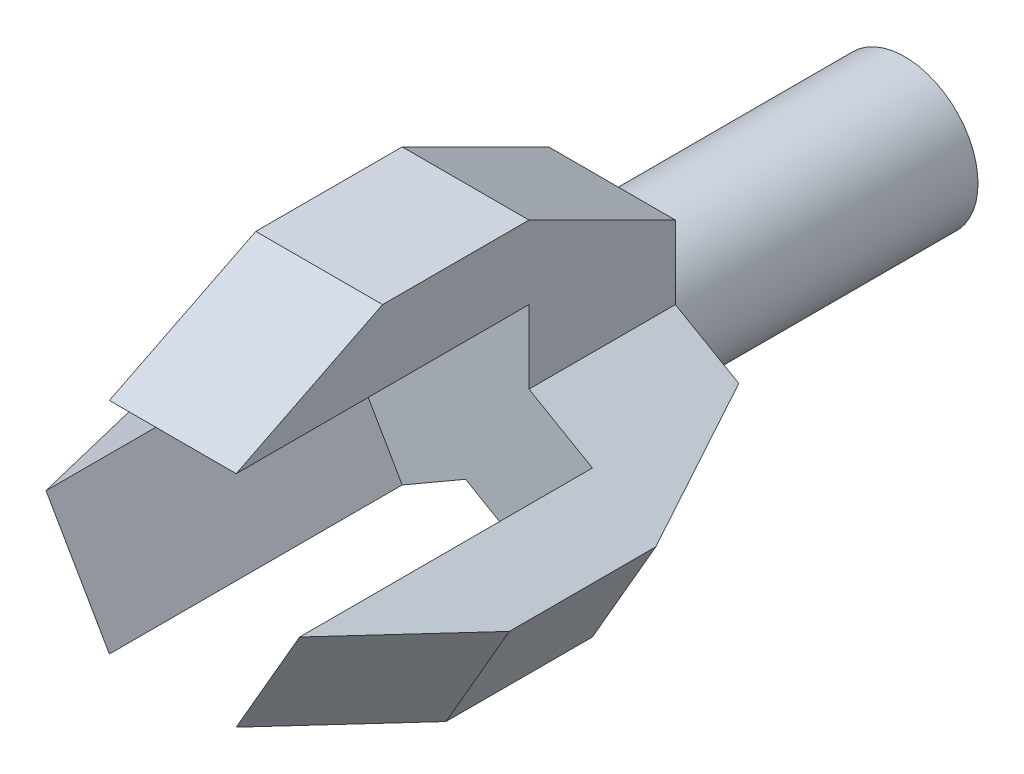
ISO-10303-21;
HEADER;
FILE_DESCRIPTION(('STEP AP214'),'2;1');
FILE_NAME('part.step','',(''),(''),'','','');
FILE_SCHEMA(('AUTOMOTIVE_DESIGN { 1 0 10303 214 1 1 1 1 }'));
ENDSEC;
DATA;
#1=APPLICATION_CONTEXT('core data for automotive mechanical design processes');
#2=APPLICATION_PROTOCOL_DEFINITION('international standard','automotive_design',2000,#1);
#3=PRODUCT_CONTEXT('',#1,'mechanical');
#4=PRODUCT('Part','Part','',(#3));
#5=PRODUCT_RELATED_PRODUCT_CATEGORY('part','',(#4));
#6=PRODUCT_DEFINITION_FORMATION('','',#4);
#7=PRODUCT_DEFINITION_CONTEXT('part definition',#1,'design');
#8=PRODUCT_DEFINITION('design','',#6,#7);
#9=PRODUCT_DEFINITION_SHAPE('','',#8);
#10=(LENGTH_UNIT() NAMED_UNIT(*) SI_UNIT(.MILLI.,.METRE.));
#11=(NAMED_UNIT(*) PLANE_ANGLE_UNIT() SI_UNIT($,.RADIAN.));
#12=(NAMED_UNIT(*) SI_UNIT($,.STERADIAN.) SOLID_ANGLE_UNIT());
#13=UNCERTAINTY_MEASURE_WITH_UNIT(LENGTH_MEASURE(1.E-05),#10,'distance_accuracy_value','');
#14=(GEOMETRIC_REPRESENTATION_CONTEXT(3) GLOBAL_UNCERTAINTY_ASSIGNED_CONTEXT((#13)) GLOBAL_UNIT_ASSIGNED_CONTEXT((#10,
#11,#12)) REPRESENTATION_CONTEXT('',''));
#15=CARTESIAN_POINT('',(0.,0.,0.));
#16=DIRECTION('',(0.,0.,1.));
#17=DIRECTION('',(1.,0.,0.));
#18=AXIS2_PLACEMENT_3D('',#15,#16,#17);
#19=CARTESIAN_POINT('',(0.,0.,200.));
#20=DIRECTION('',(0.,0.,-1.));
#21=DIRECTION('',(-1.,0.,0.));
#22=AXIS2_PLACEMENT_3D('',#19,#20,#21);
#23=CYLINDRICAL_SURFACE('',#22,50.);
#24=CARTESIAN_POINT('',(0.,0.,200.));
#25=DIRECTION('',(0.,0.,1.));
#26=DIRECTION('',(1.,0.,0.));
#27=AXIS2_PLACEMENT_3D('',#24,#25,#26);
#28=CIRCLE('',#27,50.);
#29=CARTESIAN_POINT('',(43.3012701892225,24.999999999999,200.));
#30=VERTEX_POINT('',#29);
#31=CARTESIAN_POINT('',(-43.3012701892218,25.0000000000002,200.));
#32=VERTEX_POINT('',#31);
#33=EDGE_CURVE('E11',#30,#32,#28,.T.);
#34=ORIENTED_EDGE('',*,*,#33,.F.);
#35=CARTESIAN_POINT('',(0.,0.,200.));
#36=DIRECTION('',(0.,0.,1.));
#37=DIRECTION('',(1.,0.,0.));
#38=AXIS2_PLACEMENT_3D('',#35,#36,#37);
#39=CIRCLE('',#38,50.);
#40=CARTESIAN_POINT('',(0.,-50.,200.));
#41=VERTEX_POINT('',#40);
#42=EDGE_CURVE('E361',#41,#30,#39,.T.);
#43=ORIENTED_EDGE('',*,*,#42,.F.);
#44=EDGE_CURVE('E41',#32,#41,#28,.T.);
#45=ORIENTED_EDGE('',*,*,#44,.F.);
#46=EDGE_LOOP('',(#34,#43,#45));
#47=FACE_BOUND('',#46,.T.);
#48=CARTESIAN_POINT('',(0.,0.,0.));
#49=DIRECTION('',(0.,0.,1.));
#50=DIRECTION('',(1.,0.,0.));
#51=AXIS2_PLACEMENT_3D('',#48,#49,#50);
#52=CIRCLE('',#51,50.);
#53=CARTESIAN_POINT('',(50.,0.,0.));
#54=VERTEX_POINT('',#53);
#55=EDGE_CURVE('E309',#54,#54,#52,.T.);
#56=ORIENTED_EDGE('',*,*,#55,.T.);
#57=EDGE_LOOP('',(#56));
#58=FACE_BOUND('',#57,.T.);
#59=ADVANCED_FACE('F33',(#47,#58),#23,.T.);
#60=CARTESIAN_POINT('',(0.,0.,0.));
#61=DIRECTION('',(0.,0.,1.));
#62=DIRECTION('',(1.,0.,0.));
#63=AXIS2_PLACEMENT_3D('',#60,#61,#62);
#64=PLANE('',#63);
#65=ORIENTED_EDGE('',*,*,#55,.F.);
#66=EDGE_LOOP('',(#65));
#67=FACE_BOUND('',#66,.T.);
#68=ADVANCED_FACE('F406',(#67),#64,.F.);
#69=CARTESIAN_POINT('',(5.20062834568508E-13,2.33066452422245E-13,200.));
#70=DIRECTION('',(0.,0.,1.));
#71=DIRECTION('',(1.,0.,0.));
#72=AXIS2_PLACEMENT_3D('',#69,#70,#71);
#73=PLANE('',#72);
#74=DIRECTION('',(0.,1.,0.));
#75=VECTOR('',#74,1.);
#76=CARTESIAN_POINT('',(43.3012701892218,25.0000000000002,200.));
#77=LINE('',#76,#75);
#78=CARTESIAN_POINT('',(43.3012701892224,75.0000000000016,200.));
#79=VERTEX_POINT('',#78);
#80=EDGE_CURVE('E324',#30,#79,#77,.T.);
#81=ORIENTED_EDGE('',*,*,#80,.F.);
#82=ORIENTED_EDGE('',*,*,#33,.T.);
#83=DIRECTION('',(0.,-1.,0.));
#84=VECTOR('',#83,1.);
#85=CARTESIAN_POINT('',(-43.3012701892211,74.9999999999998,200.));
#86=LINE('',#85,#84);
#87=CARTESIAN_POINT('',(-43.3012701892211,75.0000000000022,200.));
#88=VERTEX_POINT('',#87);
#89=EDGE_CURVE('E305',#88,#32,#86,.T.);
#90=ORIENTED_EDGE('',*,*,#89,.F.);
#91=DIRECTION('',(-1.,0.,0.));
#92=VECTOR('',#91,1.);
#93=CARTESIAN_POINT('',(43.3012701892223,74.9999999999991,200.));
#94=LINE('',#93,#92);
#95=EDGE_CURVE('E326',#79,#88,#94,.T.);
#96=ORIENTED_EDGE('',*,*,#95,.F.);
#97=EDGE_LOOP('',(#81,#82,#90,#96));
#98=FACE_BOUND('',#97,.T.);
#99=ADVANCED_FACE('F384',(#98),#73,.F.);
#100=CARTESIAN_POINT('',(43.3012701892218,25.0000000000002,300.));
#101=DIRECTION('',(-1.,0.,0.));
#102=DIRECTION('',(0.,-1.,0.));
#103=AXIS2_PLACEMENT_3D('',#100,#101,#102);
#104=PLANE('',#103);
#105=ORIENTED_EDGE('',*,*,#80,.T.);
#106=DIRECTION('',(0.,0.447213595499957,0.894427190999916));
#107=VECTOR('',#106,1.);
#108=CARTESIAN_POINT('',(43.3012701892224,75.0000000000017,200.));
#109=LINE('',#108,#107);
#110=CARTESIAN_POINT('',(43.3012701892228,125.000000000001,300.));
#111=VERTEX_POINT('',#110);
#112=EDGE_CURVE('E341',#79,#111,#109,.T.);
#113=ORIENTED_EDGE('',*,*,#112,.T.);
#114=DIRECTION('',(0.,0.,1.));
#115=VECTOR('',#114,1.);
#116=CARTESIAN_POINT('',(43.3012701892228,125.000000000001,300.));
#117=LINE('',#116,#115);
#118=CARTESIAN_POINT('',(43.3012701892228,125.000000000001,400.));
#119=VERTEX_POINT('',#118);
#120=EDGE_CURVE('E342',#111,#119,#117,.T.);
#121=ORIENTED_EDGE('',*,*,#120,.T.);
#122=DIRECTION('',(0.,-0.447213595499957,0.894427190999916));
#123=VECTOR('',#122,1.);
#124=CARTESIAN_POINT('',(43.3012701892228,125.000000000002,400.));
#125=LINE('',#124,#123);
#126=CARTESIAN_POINT('',(43.3012701892224,75.0000000000016,500.));
#127=VERTEX_POINT('',#126);
#128=EDGE_CURVE('E339',#119,#127,#125,.T.);
#129=ORIENTED_EDGE('',*,*,#128,.T.);
#130=DIRECTION('',(0.,0.,-1.));
#131=VECTOR('',#130,1.);
#132=CARTESIAN_POINT('',(43.3012701892224,75.0000000000016,200.));
#133=LINE('',#132,#131);
#134=CARTESIAN_POINT('',(43.3012701892224,75.0000000000016,300.));
#135=VERTEX_POINT('',#134);
#136=EDGE_CURVE('E327',#127,#135,#133,.T.);
#137=ORIENTED_EDGE('',*,*,#136,.T.);
#138=DIRECTION('',(0.,1.,0.));
#139=VECTOR('',#138,1.);
#140=CARTESIAN_POINT('',(43.3012701892218,25.0000000000002,300.));
#141=LINE('',#140,#139);
#142=CARTESIAN_POINT('',(43.3012701892225,24.999999999999,300.));
#143=VERTEX_POINT('',#142);
#144=EDGE_CURVE('E317',#143,#135,#141,.T.);
#145=ORIENTED_EDGE('',*,*,#144,.F.);
#146=DIRECTION('',(0.,0.,-1.));
#147=VECTOR('',#146,1.);
#148=CARTESIAN_POINT('',(43.3012701892218,25.0000000000002,300.));
#149=LINE('',#148,#147);
#150=EDGE_CURVE('E306',#143,#30,#149,.T.);
#151=ORIENTED_EDGE('',*,*,#150,.T.);
#152=EDGE_LOOP('',(#105,#113,#121,#129,#137,#145,#151));
#153=FACE_BOUND('',#152,.T.);
#154=ADVANCED_FACE('F336',(#153),#104,.F.);
#155=CARTESIAN_POINT('',(-43.3012701892211,74.9999999999998,300.));
#156=DIRECTION('',(1.,0.,0.));
#157=DIRECTION('',(0.,1.,0.));
#158=AXIS2_PLACEMENT_3D('',#155,#156,#157);
#159=PLANE('',#158);
#160=ORIENTED_EDGE('',*,*,#89,.T.);
#161=DIRECTION('',(0.,0.,-1.));
#162=VECTOR('',#161,1.);
#163=CARTESIAN_POINT('',(-43.3012701892215,25.0000000000008,300.));
#164=LINE('',#163,#162);
#165=CARTESIAN_POINT('',(-43.3012701892218,25.0000000000002,300.));
#166=VERTEX_POINT('',#165);
#167=EDGE_CURVE('E299',#166,#32,#164,.T.);
#168=ORIENTED_EDGE('',*,*,#167,.F.);
#169=DIRECTION('',(0.,-1.,0.));
#170=VECTOR('',#169,1.);
#171=CARTESIAN_POINT('',(-43.3012701892211,74.9999999999998,300.));
#172=LINE('',#171,#170);
#173=CARTESIAN_POINT('',(-43.3012701892211,74.9999999999998,300.));
#174=VERTEX_POINT('',#173);
#175=EDGE_CURVE('E295',#174,#166,#172,.T.);
#176=ORIENTED_EDGE('',*,*,#175,.F.);
#177=DIRECTION('',(0.,0.,1.));
#178=VECTOR('',#177,1.);
#179=CARTESIAN_POINT('',(-43.3012701892211,75.0000000000022,200.));
#180=LINE('',#179,#178);
#181=CARTESIAN_POINT('',(-43.3012701892211,75.0000000000022,500.));
#182=VERTEX_POINT('',#181);
#183=EDGE_CURVE('E49',#174,#182,#180,.T.);
#184=ORIENTED_EDGE('',*,*,#183,.T.);
#185=DIRECTION('',(0.,0.447213595499957,-0.894427190999916));
#186=VECTOR('',#185,1.);
#187=CARTESIAN_POINT('',(-43.3012701892208,125.000000000002,400.));
#188=LINE('',#187,#186);
#189=CARTESIAN_POINT('',(-43.3012701892208,125.000000000002,400.));
#190=VERTEX_POINT('',#189);
#191=EDGE_CURVE('E356',#182,#190,#188,.T.);
#192=ORIENTED_EDGE('',*,*,#191,.T.);
#193=DIRECTION('',(0.,0.,-1.));
#194=VECTOR('',#193,1.);
#195=CARTESIAN_POINT('',(-43.3012701892208,125.000000000002,300.));
#196=LINE('',#195,#194);
#197=CARTESIAN_POINT('',(-43.3012701892208,125.000000000002,300.));
#198=VERTEX_POINT('',#197);
#199=EDGE_CURVE('E350',#190,#198,#196,.T.);
#200=ORIENTED_EDGE('',*,*,#199,.T.);
#201=DIRECTION('',(0.,-0.447213595499957,-0.894427190999916));
#202=VECTOR('',#201,1.);
#203=CARTESIAN_POINT('',(-43.3012701892211,75.0000000000022,200.));
#204=LINE('',#203,#202);
#205=EDGE_CURVE('E360',#198,#88,#204,.T.);
#206=ORIENTED_EDGE('',*,*,#205,.T.);
#207=EDGE_LOOP('',(#160,#168,#176,#184,#192,#200,#206));
#208=FACE_BOUND('',#207,.T.);
#209=ADVANCED_FACE('F302',(#208),#159,.F.);
#210=CARTESIAN_POINT('',(5.20062834568508E-13,2.33066452422245E-13,300.));
#211=DIRECTION('',(0.,0.,1.));
#212=DIRECTION('',(1.,0.,0.));
#213=AXIS2_PLACEMENT_3D('',#210,#211,#212);
#214=PLANE('',#213);
#215=DIRECTION('',(-0.866025403784433,0.50000000000001,0.));
#216=VECTOR('',#215,1.);
#217=CARTESIAN_POINT('',(86.6025403784433,-9.99200722162641E-13,300.));
#218=LINE('',#217,#216);
#219=CARTESIAN_POINT('',(86.6025403784433,-9.99200722162641E-13,300.));
#220=VERTEX_POINT('',#219);
#221=EDGE_CURVE('E200',#220,#143,#218,.T.);
#222=ORIENTED_EDGE('',*,*,#221,.T.);
#223=ORIENTED_EDGE('',*,*,#144,.T.);
#224=DIRECTION('',(-1.,0.,0.));
#225=VECTOR('',#224,1.);
#226=CARTESIAN_POINT('',(43.3012701892223,74.9999999999991,300.));
#227=LINE('',#226,#225);
#228=EDGE_CURVE('E53',#135,#174,#227,.T.);
#229=ORIENTED_EDGE('',*,*,#228,.T.);
#230=ORIENTED_EDGE('',*,*,#175,.T.);
#231=DIRECTION('',(-0.866025403784448,-0.499999999999984,0.));
#232=VECTOR('',#231,1.);
#233=CARTESIAN_POINT('',(-43.3012701892218,25.0000000000002,300.));
#234=LINE('',#233,#232);
#235=CARTESIAN_POINT('',(-86.6025403784454,3.28440978118276E-13,300.));
#236=VERTEX_POINT('',#235);
#237=EDGE_CURVE('E185',#166,#236,#234,.T.);
#238=ORIENTED_EDGE('',*,*,#237,.T.);
#239=DIRECTION('',(0.499999999999985,-0.866025403784447,0.));
#240=VECTOR('',#239,1.);
#241=CARTESIAN_POINT('',(-86.6025403784433,1.57512891618694E-12,300.));
#242=LINE('',#241,#240);
#243=CARTESIAN_POINT('',(-43.3012701892229,-74.9999999999988,300.));
#244=VERTEX_POINT('',#243);
#245=EDGE_CURVE('E188',#236,#244,#242,.T.);
#246=ORIENTED_EDGE('',*,*,#245,.T.);
#247=DIRECTION('',(0.866025403784447,0.499999999999986,0.));
#248=VECTOR('',#247,1.);
#249=CARTESIAN_POINT('',(-43.3012701892229,-74.9999999999988,300.));
#250=LINE('',#249,#248);
#251=CARTESIAN_POINT('',(0.,-50.,300.));
#252=VERTEX_POINT('',#251);
#253=EDGE_CURVE('E216',#244,#252,#250,.T.);
#254=ORIENTED_EDGE('',*,*,#253,.T.);
#255=DIRECTION('',(0.866025403784432,-0.500000000000012,0.));
#256=VECTOR('',#255,1.);
#257=CARTESIAN_POINT('',(0.,-50.,300.));
#258=LINE('',#257,#256);
#259=CARTESIAN_POINT('',(43.3012701892228,-75.0000000000013,300.));
#260=VERTEX_POINT('',#259);
#261=EDGE_CURVE('E201',#252,#260,#258,.T.);
#262=ORIENTED_EDGE('',*,*,#261,.T.);
#263=DIRECTION('',(0.500000000000011,0.866025403784433,0.));
#264=VECTOR('',#263,1.);
#265=CARTESIAN_POINT('',(43.3012701892206,-75.0000000000001,300.));
#266=LINE('',#265,#264);
#267=EDGE_CURVE('E196',#260,#220,#266,.T.);
#268=ORIENTED_EDGE('',*,*,#267,.T.);
#269=EDGE_LOOP('',(#222,#223,#229,#230,#238,#246,#254,#262,#268));
#270=FACE_BOUND('',#269,.T.);
#271=ADVANCED_FACE('F292',(#270),#214,.T.);
#272=CARTESIAN_POINT('',(347.439396704133,74.9999999999993,200.));
#273=DIRECTION('',(0.,-1.,0.));
#274=DIRECTION('',(1.,0.,0.));
#275=AXIS2_PLACEMENT_3D('',#272,#273,#274);
#276=PLANE('',#275);
#277=ORIENTED_EDGE('',*,*,#228,.F.);
#278=ORIENTED_EDGE('',*,*,#136,.F.);
#279=DIRECTION('',(-1.,0.,0.));
#280=VECTOR('',#279,1.);
#281=CARTESIAN_POINT('',(347.439396704133,74.9999999999994,500.));
#282=LINE('',#281,#280);
#283=EDGE_CURVE('E347',#127,#182,#282,.T.);
#284=ORIENTED_EDGE('',*,*,#283,.T.);
#285=ORIENTED_EDGE('',*,*,#183,.F.);
#286=EDGE_LOOP('',(#277,#278,#284,#285));
#287=FACE_BOUND('',#286,.T.);
#288=ADVANCED_FACE('F395',(#287),#276,.T.);
#289=CARTESIAN_POINT('',(347.439396704133,74.9999999999993,200.));
#290=DIRECTION('',(0.,0.894427190999916,-0.447213595499957));
#291=DIRECTION('',(0.,0.447213595499957,0.894427190999916));
#292=AXIS2_PLACEMENT_3D('',#289,#290,#291);
#293=PLANE('',#292);
#294=ORIENTED_EDGE('',*,*,#112,.F.);
#295=ORIENTED_EDGE('',*,*,#95,.T.);
#296=ORIENTED_EDGE('',*,*,#205,.F.);
#297=DIRECTION('',(-1.,0.,0.));
#298=VECTOR('',#297,1.);
#299=CARTESIAN_POINT('',(347.439396704134,124.999999999999,300.));
#300=LINE('',#299,#298);
#301=EDGE_CURVE('E352',#111,#198,#300,.T.);
#302=ORIENTED_EDGE('',*,*,#301,.F.);
#303=EDGE_LOOP('',(#294,#295,#296,#302));
#304=FACE_BOUND('',#303,.T.);
#305=ADVANCED_FACE('F391',(#304),#293,.T.);
#306=CARTESIAN_POINT('',(347.439396704134,124.999999999999,300.));
#307=DIRECTION('',(0.,1.,0.));
#308=DIRECTION('',(-1.,0.,0.));
#309=AXIS2_PLACEMENT_3D('',#306,#307,#308);
#310=PLANE('',#309);
#311=ORIENTED_EDGE('',*,*,#120,.F.);
#312=ORIENTED_EDGE('',*,*,#301,.T.);
#313=ORIENTED_EDGE('',*,*,#199,.F.);
#314=DIRECTION('',(-1.,0.,0.));
#315=VECTOR('',#314,1.);
#316=CARTESIAN_POINT('',(347.439396704134,124.999999999999,400.));
#317=LINE('',#316,#315);
#318=EDGE_CURVE('E349',#119,#190,#317,.T.);
#319=ORIENTED_EDGE('',*,*,#318,.F.);
#320=EDGE_LOOP('',(#311,#312,#313,#319));
#321=FACE_BOUND('',#320,.T.);
#322=ADVANCED_FACE('F389',(#321),#310,.T.);
#323=CARTESIAN_POINT('',(347.439396704134,124.999999999999,400.));
#324=DIRECTION('',(0.,0.894427190999916,0.447213595499957));
#325=DIRECTION('',(0.,-0.447213595499957,0.894427190999916));
#326=AXIS2_PLACEMENT_3D('',#323,#324,#325);
#327=PLANE('',#326);
#328=ORIENTED_EDGE('',*,*,#128,.F.);
#329=ORIENTED_EDGE('',*,*,#318,.T.);
#330=ORIENTED_EDGE('',*,*,#191,.F.);
#331=ORIENTED_EDGE('',*,*,#283,.F.);
#332=EDGE_LOOP('',(#328,#329,#330,#331));
#333=FACE_BOUND('',#332,.T.);
#334=ADVANCED_FACE('F394',(#333),#327,.T.);
#335=CARTESIAN_POINT('',(0.,-5.66920852511594E-13,200.));
#336=DIRECTION('',(0.,0.,1.));
#337=DIRECTION('',(-0.500000000000004,-0.866025403784436,0.));
#338=AXIS2_PLACEMENT_3D('',#335,#336,#337);
#339=PLANE('',#338);
#340=DIRECTION('',(-0.866025403784448,-0.499999999999984,0.));
#341=VECTOR('',#340,1.);
#342=CARTESIAN_POINT('',(-43.3012701892218,25.0000000000002,200.));
#343=LINE('',#342,#341);
#344=CARTESIAN_POINT('',(-86.6025403784453,3.33066907387547E-13,200.));
#345=VERTEX_POINT('',#344);
#346=EDGE_CURVE('E170',#32,#345,#343,.T.);
#347=ORIENTED_EDGE('',*,*,#346,.F.);
#348=ORIENTED_EDGE('',*,*,#44,.T.);
#349=DIRECTION('',(0.866025403784447,0.499999999999986,0.));
#350=VECTOR('',#349,1.);
#351=CARTESIAN_POINT('',(-43.3012701892229,-74.9999999999988,200.));
#352=LINE('',#351,#350);
#353=CARTESIAN_POINT('',(-43.3012701892249,-75.,200.));
#354=VERTEX_POINT('',#353);
#355=EDGE_CURVE('E169',#354,#41,#352,.T.);
#356=ORIENTED_EDGE('',*,*,#355,.F.);
#357=DIRECTION('',(0.499999999999985,-0.866025403784447,0.));
#358=VECTOR('',#357,1.);
#359=CARTESIAN_POINT('',(-86.6025403784433,1.57512891618694E-12,200.));
#360=LINE('',#359,#358);
#361=EDGE_CURVE('E158',#345,#354,#360,.T.);
#362=ORIENTED_EDGE('',*,*,#361,.F.);
#363=EDGE_LOOP('',(#347,#348,#356,#362));
#364=FACE_BOUND('',#363,.T.);
#365=ADVANCED_FACE('F182',(#364),#339,.F.);
#366=DIRECTION('',(0.866025403784432,-0.500000000000012,0.));
#367=VECTOR('',#366,1.);
#368=CARTESIAN_POINT('',(0.,-50.,200.));
#369=LINE('',#368,#367);
#370=CARTESIAN_POINT('',(43.3012701892228,-75.0000000000013,200.));
#371=VERTEX_POINT('',#370);
#372=EDGE_CURVE('E193',#41,#371,#369,.T.);
#373=ORIENTED_EDGE('',*,*,#372,.F.);
#374=ORIENTED_EDGE('',*,*,#42,.T.);
#375=DIRECTION('',(-0.866025403784433,0.50000000000001,0.));
#376=VECTOR('',#375,1.);
#377=CARTESIAN_POINT('',(86.6025403784433,-9.99200722162641E-13,200.));
#378=LINE('',#377,#376);
#379=CARTESIAN_POINT('',(86.6025403784454,-2.19269047363468E-12,200.));
#380=VERTEX_POINT('',#379);
#381=EDGE_CURVE('E210',#380,#30,#378,.T.);
#382=ORIENTED_EDGE('',*,*,#381,.F.);
#383=DIRECTION('',(0.500000000000011,0.866025403784433,0.));
#384=VECTOR('',#383,1.);
#385=CARTESIAN_POINT('',(43.3012701892206,-75.0000000000001,200.));
#386=LINE('',#385,#384);
#387=EDGE_CURVE('E368',#371,#380,#386,.T.);
#388=ORIENTED_EDGE('',*,*,#387,.F.);
#389=EDGE_LOOP('',(#373,#374,#382,#388));
#390=FACE_BOUND('',#389,.T.);
#391=ADVANCED_FACE('F376',(#390),#339,.F.);
#392=CARTESIAN_POINT('',(0.,-50.,300.));
#393=DIRECTION('',(0.500000000000012,0.866025403784432,0.));
#394=DIRECTION('',(-0.866025403784432,0.500000000000012,0.));
#395=AXIS2_PLACEMENT_3D('',#392,#393,#394);
#396=PLANE('',#395);
#397=ORIENTED_EDGE('',*,*,#372,.T.);
#398=DIRECTION('',(0.387298334620738,-0.223606797749984,0.894427190999916));
#399=VECTOR('',#398,1.);
#400=CARTESIAN_POINT('',(43.3012701892229,-75.0000000000014,200.));
#401=LINE('',#400,#399);
#402=CARTESIAN_POINT('',(86.6025403784443,-100.000000000002,300.));
#403=VERTEX_POINT('',#402);
#404=EDGE_CURVE('E226',#371,#403,#401,.T.);
#405=ORIENTED_EDGE('',*,*,#404,.T.);
#406=DIRECTION('',(0.,0.,1.));
#407=VECTOR('',#406,1.);
#408=CARTESIAN_POINT('',(86.6025403784443,-100.000000000002,300.));
#409=LINE('',#408,#407);
#410=CARTESIAN_POINT('',(86.6025403784442,-100.000000000002,400.));
#411=VERTEX_POINT('',#410);
#412=EDGE_CURVE('E229',#403,#411,#409,.T.);
#413=ORIENTED_EDGE('',*,*,#412,.T.);
#414=DIRECTION('',(-0.387298334620738,0.223606797749984,0.894427190999916));
#415=VECTOR('',#414,1.);
#416=CARTESIAN_POINT('',(86.6025403784444,-100.000000000002,400.));
#417=LINE('',#416,#415);
#418=CARTESIAN_POINT('',(43.3012701892228,-75.0000000000014,500.));
#419=VERTEX_POINT('',#418);
#420=EDGE_CURVE('E242',#411,#419,#417,.T.);
#421=ORIENTED_EDGE('',*,*,#420,.T.);
#422=DIRECTION('',(0.,0.,-1.));
#423=VECTOR('',#422,1.);
#424=CARTESIAN_POINT('',(43.3012701892228,-75.0000000000013,200.));
#425=LINE('',#424,#423);
#426=EDGE_CURVE('E223',#419,#260,#425,.T.);
#427=ORIENTED_EDGE('',*,*,#426,.T.);
#428=ORIENTED_EDGE('',*,*,#261,.F.);
#429=DIRECTION('',(0.,0.,-1.));
#430=VECTOR('',#429,1.);
#431=CARTESIAN_POINT('',(0.,-50.,300.));
#432=LINE('',#431,#430);
#433=EDGE_CURVE('E205',#252,#41,#432,.T.);
#434=ORIENTED_EDGE('',*,*,#433,.T.);
#435=EDGE_LOOP('',(#397,#405,#413,#421,#427,#428,#434));
#436=FACE_BOUND('',#435,.T.);
#437=ADVANCED_FACE('F374',(#436),#396,.F.);
#438=CARTESIAN_POINT('',(86.6025403784433,-9.99200722162641E-13,300.));
#439=DIRECTION('',(-0.50000000000001,-0.866025403784433,0.));
#440=DIRECTION('',(0.866025403784433,-0.50000000000001,0.));
#441=AXIS2_PLACEMENT_3D('',#438,#439,#440);
#442=PLANE('',#441);
#443=ORIENTED_EDGE('',*,*,#381,.T.);
#444=ORIENTED_EDGE('',*,*,#150,.F.);
#445=ORIENTED_EDGE('',*,*,#221,.F.);
#446=DIRECTION('',(0.,0.,1.));
#447=VECTOR('',#446,1.);
#448=CARTESIAN_POINT('',(86.6025403784454,-2.19269047363468E-12,200.));
#449=LINE('',#448,#447);
#450=CARTESIAN_POINT('',(86.6025403784454,-2.2065682614425E-12,500.));
#451=VERTEX_POINT('',#450);
#452=EDGE_CURVE('E220',#220,#451,#449,.T.);
#453=ORIENTED_EDGE('',*,*,#452,.T.);
#454=DIRECTION('',(0.387298334620738,-0.223606797749983,-0.894427190999916));
#455=VECTOR('',#454,1.);
#456=CARTESIAN_POINT('',(129.903810567667,-25.0000000000027,400.));
#457=LINE('',#456,#455);
#458=CARTESIAN_POINT('',(129.903810567667,-25.0000000000027,400.));
#459=VERTEX_POINT('',#458);
#460=EDGE_CURVE('E245',#451,#459,#457,.T.);
#461=ORIENTED_EDGE('',*,*,#460,.T.);
#462=DIRECTION('',(0.,0.,-1.));
#463=VECTOR('',#462,1.);
#464=CARTESIAN_POINT('',(129.903810567667,-25.0000000000027,300.));
#465=LINE('',#464,#463);
#466=CARTESIAN_POINT('',(129.903810567667,-25.0000000000027,300.));
#467=VERTEX_POINT('',#466);
#468=EDGE_CURVE('E238',#459,#467,#465,.T.);
#469=ORIENTED_EDGE('',*,*,#468,.T.);
#470=DIRECTION('',(-0.387298334620739,0.223606797749983,-0.894427190999916));
#471=VECTOR('',#470,1.);
#472=CARTESIAN_POINT('',(86.6025403784454,-2.19269047363468E-12,200.));
#473=LINE('',#472,#471);
#474=EDGE_CURVE('E249',#467,#380,#473,.T.);
#475=ORIENTED_EDGE('',*,*,#474,.T.);
#476=EDGE_LOOP('',(#443,#444,#445,#453,#461,#469,#475));
#477=FACE_BOUND('',#476,.T.);
#478=ADVANCED_FACE('F380',(#477),#442,.F.);
#479=CARTESIAN_POINT('',(-43.3012701892218,25.0000000000002,300.));
#480=DIRECTION('',(0.499999999999984,-0.866025403784448,0.));
#481=DIRECTION('',(0.866025403784448,0.499999999999984,0.));
#482=AXIS2_PLACEMENT_3D('',#479,#480,#481);
#483=PLANE('',#482);
#484=ORIENTED_EDGE('',*,*,#346,.T.);
#485=DIRECTION('',(-0.387298334620745,-0.223606797749971,0.894427190999916));
#486=VECTOR('',#485,1.);
#487=CARTESIAN_POINT('',(-86.6025403784456,2.22044604925031E-13,200.000000000001));
#488=LINE('',#487,#486);
#489=CARTESIAN_POINT('',(-129.903810567668,-24.9999999999989,300.));
#490=VERTEX_POINT('',#489);
#491=EDGE_CURVE('E164',#345,#490,#488,.T.);
#492=ORIENTED_EDGE('',*,*,#491,.T.);
#493=DIRECTION('',(0.,0.,1.));
#494=VECTOR('',#493,1.);
#495=CARTESIAN_POINT('',(-129.903810567668,-24.9999999999989,300.));
#496=LINE('',#495,#494);
#497=CARTESIAN_POINT('',(-129.903810567668,-24.9999999999988,400.));
#498=VERTEX_POINT('',#497);
#499=EDGE_CURVE('E286',#490,#498,#496,.T.);
#500=ORIENTED_EDGE('',*,*,#499,.T.);
#501=DIRECTION('',(0.387298334620745,0.223606797749971,0.894427190999917));
#502=VECTOR('',#501,1.);
#503=CARTESIAN_POINT('',(-129.903810567668,-24.9999999999989,400.));
#504=LINE('',#503,#502);
#505=CARTESIAN_POINT('',(-86.6025403784455,4.44089209850063E-13,500.));
#506=VERTEX_POINT('',#505);
#507=EDGE_CURVE('E267',#498,#506,#504,.T.);
#508=ORIENTED_EDGE('',*,*,#507,.T.);
#509=DIRECTION('',(0.,0.,-1.));
#510=VECTOR('',#509,1.);
#511=CARTESIAN_POINT('',(-86.6025403784453,3.33066907387547E-13,200.));
#512=LINE('',#511,#510);
#513=EDGE_CURVE('E251',#506,#236,#512,.T.);
#514=ORIENTED_EDGE('',*,*,#513,.T.);
#515=ORIENTED_EDGE('',*,*,#237,.F.);
#516=ORIENTED_EDGE('',*,*,#167,.T.);
#517=EDGE_LOOP('',(#484,#492,#500,#508,#514,#515,#516));
#518=FACE_BOUND('',#517,.T.);
#519=ADVANCED_FACE('F289',(#518),#483,.F.);
#520=CARTESIAN_POINT('',(-43.3012701892229,-74.9999999999988,300.));
#521=DIRECTION('',(-0.499999999999986,0.866025403784447,0.));
#522=DIRECTION('',(-0.866025403784447,-0.499999999999986,0.));
#523=AXIS2_PLACEMENT_3D('',#520,#521,#522);
#524=PLANE('',#523);
#525=ORIENTED_EDGE('',*,*,#355,.T.);
#526=ORIENTED_EDGE('',*,*,#433,.F.);
#527=ORIENTED_EDGE('',*,*,#253,.F.);
#528=DIRECTION('',(0.,0.,1.));
#529=VECTOR('',#528,1.);
#530=CARTESIAN_POINT('',(-43.3012701892249,-75.,200.));
#531=LINE('',#530,#529);
#532=CARTESIAN_POINT('',(-43.301270189225,-75.,500.));
#533=VERTEX_POINT('',#532);
#534=EDGE_CURVE('E180',#244,#533,#531,.T.);
#535=ORIENTED_EDGE('',*,*,#534,.T.);
#536=DIRECTION('',(-0.387298334620745,-0.223606797749972,-0.894427190999916));
#537=VECTOR('',#536,1.);
#538=CARTESIAN_POINT('',(-86.6025403784472,-99.9999999999992,400.));
#539=LINE('',#538,#537);
#540=CARTESIAN_POINT('',(-86.6025403784472,-99.9999999999992,400.));
#541=VERTEX_POINT('',#540);
#542=EDGE_CURVE('E257',#533,#541,#539,.T.);
#543=ORIENTED_EDGE('',*,*,#542,.T.);
#544=DIRECTION('',(0.,0.,-1.));
#545=VECTOR('',#544,1.);
#546=CARTESIAN_POINT('',(-86.6025403784472,-99.9999999999993,300.));
#547=LINE('',#546,#545);
#548=CARTESIAN_POINT('',(-86.6025403784472,-99.9999999999993,300.));
#549=VERTEX_POINT('',#548);
#550=EDGE_CURVE('E179',#541,#549,#547,.T.);
#551=ORIENTED_EDGE('',*,*,#550,.T.);
#552=DIRECTION('',(0.387298334620745,0.223606797749972,-0.894427190999916));
#553=VECTOR('',#552,1.);
#554=CARTESIAN_POINT('',(-43.3012701892249,-75.,200.));
#555=LINE('',#554,#553);
#556=EDGE_CURVE('E162',#549,#354,#555,.T.);
#557=ORIENTED_EDGE('',*,*,#556,.T.);
#558=EDGE_LOOP('',(#525,#526,#527,#535,#543,#551,#557));
#559=FACE_BOUND('',#558,.T.);
#560=ADVANCED_FACE('F174',(#559),#524,.F.);
#561=CARTESIAN_POINT('',(-206.452959791578,-507.587015731978,200.));
#562=DIRECTION('',(-0.866025403784433,0.50000000000001,0.));
#563=DIRECTION('',(-0.50000000000001,-0.866025403784433,0.));
#564=AXIS2_PLACEMENT_3D('',#561,#562,#563);
#565=PLANE('',#564);
#566=ORIENTED_EDGE('',*,*,#267,.F.);
#567=ORIENTED_EDGE('',*,*,#426,.F.);
#568=DIRECTION('',(0.50000000000001,0.866025403784433,0.));
#569=VECTOR('',#568,1.);
#570=CARTESIAN_POINT('',(-206.452959791578,-507.587015731978,500.));
#571=LINE('',#570,#569);
#572=EDGE_CURVE('E234',#419,#451,#571,.T.);
#573=ORIENTED_EDGE('',*,*,#572,.T.);
#574=ORIENTED_EDGE('',*,*,#452,.F.);
#575=EDGE_LOOP('',(#566,#567,#573,#574));
#576=FACE_BOUND('',#575,.T.);
#577=ADVANCED_FACE('F485',(#576),#565,.T.);
#578=CARTESIAN_POINT('',(-206.452959791578,-507.587015731978,200.));
#579=DIRECTION('',(0.774596669241478,-0.447213595499967,-0.447213595499957));
#580=DIRECTION('',(0.50000000000001,0.866025403784433,0.));
#581=AXIS2_PLACEMENT_3D('',#578,#579,#580);
#582=PLANE('',#581);
#583=ORIENTED_EDGE('',*,*,#404,.F.);
#584=ORIENTED_EDGE('',*,*,#387,.T.);
#585=ORIENTED_EDGE('',*,*,#474,.F.);
#586=DIRECTION('',(0.50000000000001,0.866025403784433,0.));
#587=VECTOR('',#586,1.);
#588=CARTESIAN_POINT('',(-163.151689602356,-532.587015731978,300.));
#589=LINE('',#588,#587);
#590=EDGE_CURVE('E240',#403,#467,#589,.T.);
#591=ORIENTED_EDGE('',*,*,#590,.F.);
#592=EDGE_LOOP('',(#583,#584,#585,#591));
#593=FACE_BOUND('',#592,.T.);
#594=ADVANCED_FACE('F494',(#593),#582,.T.);
#595=CARTESIAN_POINT('',(-163.151689602356,-532.587015731978,300.));
#596=DIRECTION('',(0.866025403784433,-0.50000000000001,0.));
#597=DIRECTION('',(0.50000000000001,0.866025403784433,0.));
#598=AXIS2_PLACEMENT_3D('',#595,#596,#597);
#599=PLANE('',#598);
#600=ORIENTED_EDGE('',*,*,#412,.F.);
#601=ORIENTED_EDGE('',*,*,#590,.T.);
#602=ORIENTED_EDGE('',*,*,#468,.F.);
#603=DIRECTION('',(0.50000000000001,0.866025403784433,0.));
#604=VECTOR('',#603,1.);
#605=CARTESIAN_POINT('',(-163.151689602356,-532.587015731978,400.));
#606=LINE('',#605,#604);
#607=EDGE_CURVE('E237',#411,#459,#606,.T.);
#608=ORIENTED_EDGE('',*,*,#607,.F.);
#609=EDGE_LOOP('',(#600,#601,#602,#608));
#610=FACE_BOUND('',#609,.T.);
#611=ADVANCED_FACE('F504',(#610),#599,.T.);
#612=CARTESIAN_POINT('',(-163.151689602356,-532.587015731978,400.));
#613=DIRECTION('',(0.774596669241478,-0.447213595499967,0.447213595499957));
#614=DIRECTION('',(0.50000000000001,0.866025403784433,0.));
#615=AXIS2_PLACEMENT_3D('',#612,#613,#614);
#616=PLANE('',#615);
#617=ORIENTED_EDGE('',*,*,#420,.F.);
#618=ORIENTED_EDGE('',*,*,#607,.T.);
#619=ORIENTED_EDGE('',*,*,#460,.F.);
#620=ORIENTED_EDGE('',*,*,#572,.F.);
#621=EDGE_LOOP('',(#617,#618,#619,#620));
#622=FACE_BOUND('',#621,.T.);
#623=ADVANCED_FACE('F513',(#622),#616,.T.);
#624=CARTESIAN_POINT('',(-379.658040548459,507.587015731992,200.));
#625=DIRECTION('',(0.866025403784447,0.499999999999986,0.));
#626=DIRECTION('',(-0.499999999999986,0.866025403784447,0.));
#627=AXIS2_PLACEMENT_3D('',#624,#625,#626);
#628=PLANE('',#627);
#629=ORIENTED_EDGE('',*,*,#245,.F.);
#630=ORIENTED_EDGE('',*,*,#513,.F.);
#631=DIRECTION('',(0.499999999999986,-0.866025403784447,0.));
#632=VECTOR('',#631,1.);
#633=CARTESIAN_POINT('',(-379.658040548459,507.587015731992,500.));
#634=LINE('',#633,#632);
#635=EDGE_CURVE('E264',#506,#533,#634,.T.);
#636=ORIENTED_EDGE('',*,*,#635,.T.);
#637=ORIENTED_EDGE('',*,*,#534,.F.);
#638=EDGE_LOOP('',(#629,#630,#636,#637));
#639=FACE_BOUND('',#638,.T.);
#640=ADVANCED_FACE('F276',(#639),#628,.T.);
#641=CARTESIAN_POINT('',(-379.658040548459,507.587015731992,200.));
#642=DIRECTION('',(-0.774596669241491,-0.447213595499945,-0.447213595499957));
#643=DIRECTION('',(-0.499999999999996,0.,0.866025403784441));
#644=AXIS2_PLACEMENT_3D('',#641,#642,#643);
#645=PLANE('',#644);
#646=ORIENTED_EDGE('',*,*,#491,.F.);
#647=ORIENTED_EDGE('',*,*,#361,.T.);
#648=ORIENTED_EDGE('',*,*,#556,.F.);
#649=DIRECTION('',(0.499999999999986,-0.866025403784447,0.));
#650=VECTOR('',#649,1.);
#651=CARTESIAN_POINT('',(-422.959310737681,482.587015731993,300.));
#652=LINE('',#651,#650);
#653=EDGE_CURVE('E265',#490,#549,#652,.T.);
#654=ORIENTED_EDGE('',*,*,#653,.F.);
#655=EDGE_LOOP('',(#646,#647,#648,#654));
#656=FACE_BOUND('',#655,.T.);
#657=ADVANCED_FACE('F160',(#656),#645,.T.);
#658=CARTESIAN_POINT('',(-422.959310737681,482.587015731993,300.));
#659=DIRECTION('',(-0.866025403784447,-0.499999999999986,0.));
#660=DIRECTION('',(0.499999999999986,-0.866025403784447,0.));
#661=AXIS2_PLACEMENT_3D('',#658,#659,#660);
#662=PLANE('',#661);
#663=ORIENTED_EDGE('',*,*,#499,.F.);
#664=ORIENTED_EDGE('',*,*,#653,.T.);
#665=ORIENTED_EDGE('',*,*,#550,.F.);
#666=DIRECTION('',(0.499999999999986,-0.866025403784447,0.));
#667=VECTOR('',#666,1.);
#668=CARTESIAN_POINT('',(-422.959310737681,482.587015731993,400.));
#669=LINE('',#668,#667);
#670=EDGE_CURVE('E268',#498,#541,#669,.T.);
#671=ORIENTED_EDGE('',*,*,#670,.F.);
#672=EDGE_LOOP('',(#663,#664,#665,#671));
#673=FACE_BOUND('',#672,.T.);
#674=ADVANCED_FACE('F285',(#673),#662,.T.);
#675=CARTESIAN_POINT('',(-422.959310737681,482.587015731993,400.));
#676=DIRECTION('',(-0.774596669241491,-0.447213595499945,0.447213595499957));
#677=DIRECTION('',(0.499999999999995,0.,0.866025403784441));
#678=AXIS2_PLACEMENT_3D('',#675,#676,#677);
#679=PLANE('',#678);
#680=ORIENTED_EDGE('',*,*,#507,.F.);
#681=ORIENTED_EDGE('',*,*,#670,.T.);
#682=ORIENTED_EDGE('',*,*,#542,.F.);
#683=ORIENTED_EDGE('',*,*,#635,.F.);
#684=EDGE_LOOP('',(#680,#681,#682,#683));
#685=FACE_BOUND('',#684,.T.);
#686=ADVANCED_FACE('F280',(#685),#679,.T.);
#687=CLOSED_SHELL('',(#59,#68,#99,#154,#209,#271,#288,#305,#322,#334,#365,#391,#437,#478,#519,
#560,#577,#594,#611,#623,#640,#657,#674,#686));
#688=MANIFOLD_SOLID_BREP('B2',#687);
#689=ADVANCED_BREP_SHAPE_REPRESENTATION('',(#18,#688),#14);
#690=SHAPE_DEFINITION_REPRESENTATION(#9,#689);
ENDSEC;
END-ISO-10303-21;
